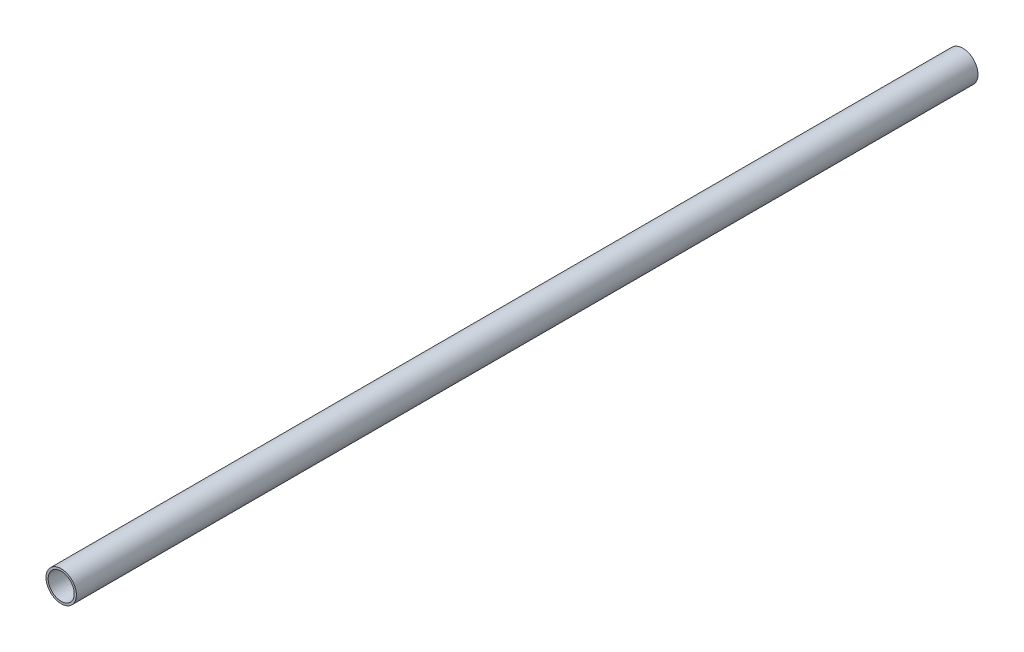
ISO-10303-21;
HEADER;
FILE_DESCRIPTION(('STEP AP214'),'2;1');
FILE_NAME('part.step','',(''),(''),'','','');
FILE_SCHEMA(('AUTOMOTIVE_DESIGN { 1 0 10303 214 1 1 1 1 }'));
ENDSEC;
DATA;
#1=APPLICATION_CONTEXT('core data for automotive mechanical design processes');
#2=APPLICATION_PROTOCOL_DEFINITION('international standard','automotive_design',2000,#1);
#3=PRODUCT_CONTEXT('',#1,'mechanical');
#4=PRODUCT('Part','Part','',(#3));
#5=PRODUCT_RELATED_PRODUCT_CATEGORY('part','',(#4));
#6=PRODUCT_DEFINITION_FORMATION('','',#4);
#7=PRODUCT_DEFINITION_CONTEXT('part definition',#1,'design');
#8=PRODUCT_DEFINITION('design','',#6,#7);
#9=PRODUCT_DEFINITION_SHAPE('','',#8);
#10=(LENGTH_UNIT() NAMED_UNIT(*) SI_UNIT(.MILLI.,.METRE.));
#11=(NAMED_UNIT(*) PLANE_ANGLE_UNIT() SI_UNIT($,.RADIAN.));
#12=(NAMED_UNIT(*) SI_UNIT($,.STERADIAN.) SOLID_ANGLE_UNIT());
#13=UNCERTAINTY_MEASURE_WITH_UNIT(LENGTH_MEASURE(1.E-05),#10,'distance_accuracy_value','');
#14=(GEOMETRIC_REPRESENTATION_CONTEXT(3) GLOBAL_UNCERTAINTY_ASSIGNED_CONTEXT((#13)) GLOBAL_UNIT_ASSIGNED_CONTEXT((#10,
#11,#12)) REPRESENTATION_CONTEXT('',''));
#15=CARTESIAN_POINT('',(0.,0.,0.));
#16=DIRECTION('',(0.,0.,1.));
#17=DIRECTION('',(1.,0.,0.));
#18=AXIS2_PLACEMENT_3D('',#15,#16,#17);
#19=CARTESIAN_POINT('',(0.,0.,415.));
#20=DIRECTION('',(0.,0.,1.));
#21=DIRECTION('',(1.,0.,0.));
#22=AXIS2_PLACEMENT_3D('',#19,#20,#21);
#23=PLANE('',#22);
#24=CARTESIAN_POINT('',(0.,0.,415.));
#25=DIRECTION('',(0.,0.,1.));
#26=DIRECTION('',(1.,0.,0.));
#27=AXIS2_PLACEMENT_3D('',#24,#25,#26);
#28=CIRCLE('',#27,7.);
#29=CARTESIAN_POINT('',(7.,0.,415.));
#30=VERTEX_POINT('',#29);
#31=EDGE_CURVE('E10',#30,#30,#28,.T.);
#32=ORIENTED_EDGE('',*,*,#31,.T.);
#33=EDGE_LOOP('',(#32));
#34=FACE_BOUND('',#33,.T.);
#35=CARTESIAN_POINT('',(0.,0.,415.));
#36=DIRECTION('',(0.,0.,1.));
#37=DIRECTION('',(1.,0.,0.));
#38=AXIS2_PLACEMENT_3D('',#35,#36,#37);
#39=CIRCLE('',#38,6.);
#40=CARTESIAN_POINT('',(6.,0.,415.));
#41=VERTEX_POINT('',#40);
#42=EDGE_CURVE('E54',#41,#41,#39,.T.);
#43=ORIENTED_EDGE('',*,*,#42,.F.);
#44=EDGE_LOOP('',(#43));
#45=FACE_BOUND('',#44,.T.);
#46=ADVANCED_FACE('F41',(#34,#45),#23,.T.);
#47=CARTESIAN_POINT('',(0.,0.,0.));
#48=DIRECTION('',(0.,0.,1.));
#49=DIRECTION('',(1.,0.,0.));
#50=AXIS2_PLACEMENT_3D('',#47,#48,#49);
#51=PLANE('',#50);
#52=CARTESIAN_POINT('',(0.,0.,0.));
#53=DIRECTION('',(0.,0.,1.));
#54=DIRECTION('',(1.,0.,0.));
#55=AXIS2_PLACEMENT_3D('',#52,#53,#54);
#56=CIRCLE('',#55,7.);
#57=CARTESIAN_POINT('',(7.,0.,0.));
#58=VERTEX_POINT('',#57);
#59=EDGE_CURVE('E45',#58,#58,#56,.T.);
#60=ORIENTED_EDGE('',*,*,#59,.F.);
#61=EDGE_LOOP('',(#60));
#62=FACE_BOUND('',#61,.T.);
#63=CARTESIAN_POINT('',(0.,0.,0.));
#64=DIRECTION('',(0.,0.,1.));
#65=DIRECTION('',(1.,0.,0.));
#66=AXIS2_PLACEMENT_3D('',#63,#64,#65);
#67=CIRCLE('',#66,6.);
#68=CARTESIAN_POINT('',(6.,0.,0.));
#69=VERTEX_POINT('',#68);
#70=EDGE_CURVE('E56',#69,#69,#67,.T.);
#71=ORIENTED_EDGE('',*,*,#70,.T.);
#72=EDGE_LOOP('',(#71));
#73=FACE_BOUND('',#72,.T.);
#74=ADVANCED_FACE('F68',(#62,#73),#51,.F.);
#75=CARTESIAN_POINT('',(0.,0.,415.));
#76=DIRECTION('',(0.,0.,-1.));
#77=DIRECTION('',(-1.,0.,0.));
#78=AXIS2_PLACEMENT_3D('',#75,#76,#77);
#79=CYLINDRICAL_SURFACE('',#78,7.);
#80=ORIENTED_EDGE('',*,*,#31,.F.);
#81=EDGE_LOOP('',(#80));
#82=FACE_BOUND('',#81,.T.);
#83=ORIENTED_EDGE('',*,*,#59,.T.);
#84=EDGE_LOOP('',(#83));
#85=FACE_BOUND('',#84,.T.);
#86=ADVANCED_FACE('F43',(#82,#85),#79,.T.);
#87=CARTESIAN_POINT('',(0.,0.,415.));
#88=DIRECTION('',(0.,0.,-1.));
#89=DIRECTION('',(-1.,0.,0.));
#90=AXIS2_PLACEMENT_3D('',#87,#88,#89);
#91=CYLINDRICAL_SURFACE('',#90,6.);
#92=ORIENTED_EDGE('',*,*,#42,.T.);
#93=EDGE_LOOP('',(#92));
#94=FACE_BOUND('',#93,.T.);
#95=ORIENTED_EDGE('',*,*,#70,.F.);
#96=EDGE_LOOP('',(#95));
#97=FACE_BOUND('',#96,.T.);
#98=ADVANCED_FACE('F64',(#94,#97),#91,.F.);
#99=CLOSED_SHELL('',(#46,#74,#86,#98));
#100=MANIFOLD_SOLID_BREP('B2',#99);
#101=ADVANCED_BREP_SHAPE_REPRESENTATION('',(#18,#100),#14);
#102=SHAPE_DEFINITION_REPRESENTATION(#9,#101);
ENDSEC;
END-ISO-10303-21;
